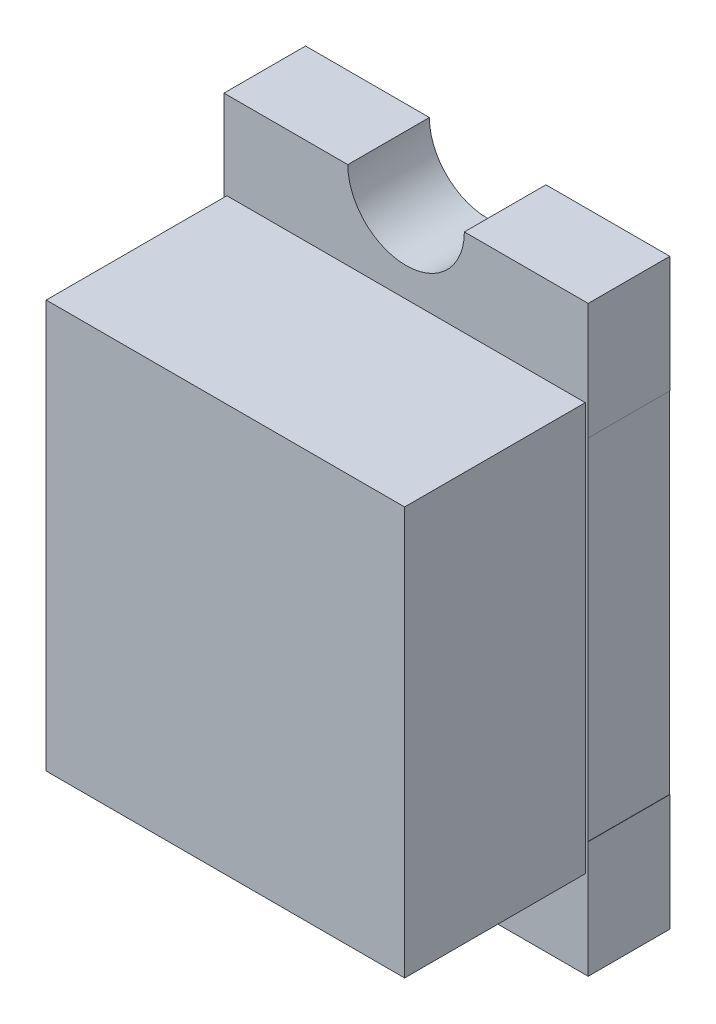
ISO-10303-21;
HEADER;
FILE_DESCRIPTION(('STEP AP214'),'2;1');
FILE_NAME('part.step','',(''),(''),'','','');
FILE_SCHEMA(('AUTOMOTIVE_DESIGN { 1 0 10303 214 1 1 1 1 }'));
ENDSEC;
DATA;
#1=APPLICATION_CONTEXT('core data for automotive mechanical design processes');
#2=APPLICATION_PROTOCOL_DEFINITION('international standard','automotive_design',2000,#1);
#3=PRODUCT_CONTEXT('',#1,'mechanical');
#4=PRODUCT('Part','Part','',(#3));
#5=PRODUCT_RELATED_PRODUCT_CATEGORY('part','',(#4));
#6=PRODUCT_DEFINITION_FORMATION('','',#4);
#7=PRODUCT_DEFINITION_CONTEXT('part definition',#1,'design');
#8=PRODUCT_DEFINITION('design','',#6,#7);
#9=PRODUCT_DEFINITION_SHAPE('','',#8);
#10=(LENGTH_UNIT() NAMED_UNIT(*) SI_UNIT(.MILLI.,.METRE.));
#11=(NAMED_UNIT(*) PLANE_ANGLE_UNIT() SI_UNIT($,.RADIAN.));
#12=(NAMED_UNIT(*) SI_UNIT($,.STERADIAN.) SOLID_ANGLE_UNIT());
#13=UNCERTAINTY_MEASURE_WITH_UNIT(LENGTH_MEASURE(1.E-05),#10,'distance_accuracy_value','');
#14=(GEOMETRIC_REPRESENTATION_CONTEXT(3) GLOBAL_UNCERTAINTY_ASSIGNED_CONTEXT((#13)) GLOBAL_UNIT_ASSIGNED_CONTEXT((#10,
#11,#12)) REPRESENTATION_CONTEXT('',''));
#15=CARTESIAN_POINT('',(0.,0.,0.));
#16=DIRECTION('',(0.,0.,1.));
#17=DIRECTION('',(1.,0.,0.));
#18=AXIS2_PLACEMENT_3D('',#15,#16,#17);
#19=CARTESIAN_POINT('',(0.,1.,0.));
#20=DIRECTION('',(0.,0.,1.));
#21=DIRECTION('',(0.,-1.,0.));
#22=AXIS2_PLACEMENT_3D('',#19,#20,#21);
#23=CYLINDRICAL_SURFACE('',#22,0.2);
#24=DIRECTION('',(0.,0.,1.));
#25=VECTOR('',#24,1.);
#26=CARTESIAN_POINT('',(-0.2,1.,0.));
#27=LINE('',#26,#25);
#28=CARTESIAN_POINT('',(-0.2,1.,0.));
#29=VERTEX_POINT('',#28);
#30=CARTESIAN_POINT('',(-0.2,1.,0.28));
#31=VERTEX_POINT('',#30);
#32=EDGE_CURVE('E296',#29,#31,#27,.T.);
#33=ORIENTED_EDGE('',*,*,#32,.T.);
#34=CARTESIAN_POINT('',(0.,1.,0.28));
#35=DIRECTION('',(0.,0.,1.));
#36=DIRECTION('',(0.,1.,0.));
#37=AXIS2_PLACEMENT_3D('',#34,#35,#36);
#38=CIRCLE('',#37,0.2);
#39=CARTESIAN_POINT('',(0.2,1.,0.28));
#40=VERTEX_POINT('',#39);
#41=EDGE_CURVE('E95',#31,#40,#38,.T.);
#42=ORIENTED_EDGE('',*,*,#41,.T.);
#43=DIRECTION('',(0.,0.,1.));
#44=VECTOR('',#43,1.);
#45=CARTESIAN_POINT('',(0.2,1.,0.));
#46=LINE('',#45,#44);
#47=CARTESIAN_POINT('',(0.2,1.,0.));
#48=VERTEX_POINT('',#47);
#49=EDGE_CURVE('E351',#48,#40,#46,.T.);
#50=ORIENTED_EDGE('',*,*,#49,.F.);
#51=CARTESIAN_POINT('',(0.,1.,0.));
#52=DIRECTION('',(0.,0.,1.));
#53=DIRECTION('',(0.,1.,0.));
#54=AXIS2_PLACEMENT_3D('',#51,#52,#53);
#55=CIRCLE('',#54,0.2);
#56=EDGE_CURVE('E445',#29,#48,#55,.T.);
#57=ORIENTED_EDGE('',*,*,#56,.F.);
#58=EDGE_LOOP('',(#33,#42,#50,#57));
#59=FACE_BOUND('',#58,.T.);
#60=ADVANCED_FACE('F18',(#59),#23,.F.);
#61=CARTESIAN_POINT('',(0.624,-0.6,1.480000416667));
#62=DIRECTION('',(0.,-1.,0.));
#63=DIRECTION('',(-1.,0.,0.));
#64=AXIS2_PLACEMENT_3D('',#61,#62,#63);
#65=PLANE('',#64);
#66=DIRECTION('',(0.,0.,-1.));
#67=VECTOR('',#66,1.);
#68=CARTESIAN_POINT('',(0.625,-0.6,1.480000416667));
#69=LINE('',#68,#67);
#70=CARTESIAN_POINT('',(0.625,-0.6,0.28));
#71=VERTEX_POINT('',#70);
#72=CARTESIAN_POINT('',(0.625,-0.6,0.));
#73=VERTEX_POINT('',#72);
#74=EDGE_CURVE('E411',#71,#73,#69,.T.);
#75=ORIENTED_EDGE('',*,*,#74,.T.);
#76=DIRECTION('',(-1.,0.,0.));
#77=VECTOR('',#76,1.);
#78=CARTESIAN_POINT('',(0.624,-0.6,0.));
#79=LINE('',#78,#77);
#80=CARTESIAN_POINT('',(0.624,-0.6,0.));
#81=VERTEX_POINT('',#80);
#82=EDGE_CURVE('E315',#73,#81,#79,.T.);
#83=ORIENTED_EDGE('',*,*,#82,.T.);
#84=DIRECTION('',(0.,0.,-1.));
#85=VECTOR('',#84,1.);
#86=CARTESIAN_POINT('',(0.624,-0.6,1.480000416667));
#87=LINE('',#86,#85);
#88=CARTESIAN_POINT('',(0.624,-0.6,0.28));
#89=VERTEX_POINT('',#88);
#90=EDGE_CURVE('E29',#89,#81,#87,.T.);
#91=ORIENTED_EDGE('',*,*,#90,.F.);
#92=DIRECTION('',(-1.,0.,0.));
#93=VECTOR('',#92,1.);
#94=CARTESIAN_POINT('',(0.624,-0.6,0.28));
#95=LINE('',#94,#93);
#96=EDGE_CURVE('E350',#71,#89,#95,.T.);
#97=ORIENTED_EDGE('',*,*,#96,.F.);
#98=EDGE_LOOP('',(#75,#83,#91,#97));
#99=FACE_BOUND('',#98,.T.);
#100=ADVANCED_FACE('F716',(#99),#65,.F.);
#101=CARTESIAN_POINT('',(0.624,0.6,1.480000416667));
#102=DIRECTION('',(0.,1.,0.));
#103=DIRECTION('',(1.,0.,0.));
#104=AXIS2_PLACEMENT_3D('',#101,#102,#103);
#105=PLANE('',#104);
#106=DIRECTION('',(0.,0.,-1.));
#107=VECTOR('',#106,1.);
#108=CARTESIAN_POINT('',(0.624,0.6,1.480000416667));
#109=LINE('',#108,#107);
#110=CARTESIAN_POINT('',(0.624,0.6,0.28));
#111=VERTEX_POINT('',#110);
#112=CARTESIAN_POINT('',(0.624,0.6,0.));
#113=VERTEX_POINT('',#112);
#114=EDGE_CURVE('E11',#111,#113,#109,.T.);
#115=ORIENTED_EDGE('',*,*,#114,.T.);
#116=DIRECTION('',(1.,0.,0.));
#117=VECTOR('',#116,1.);
#118=CARTESIAN_POINT('',(0.624,0.6,0.));
#119=LINE('',#118,#117);
#120=CARTESIAN_POINT('',(0.625,0.6,0.));
#121=VERTEX_POINT('',#120);
#122=EDGE_CURVE('E336',#113,#121,#119,.T.);
#123=ORIENTED_EDGE('',*,*,#122,.T.);
#124=DIRECTION('',(0.,0.,-1.));
#125=VECTOR('',#124,1.);
#126=CARTESIAN_POINT('',(0.625,0.6,1.480000416667));
#127=LINE('',#126,#125);
#128=CARTESIAN_POINT('',(0.625,0.6,0.28));
#129=VERTEX_POINT('',#128);
#130=EDGE_CURVE('E291',#129,#121,#127,.T.);
#131=ORIENTED_EDGE('',*,*,#130,.F.);
#132=DIRECTION('',(1.,0.,0.));
#133=VECTOR('',#132,1.);
#134=CARTESIAN_POINT('',(0.624,0.6,0.28));
#135=LINE('',#134,#133);
#136=EDGE_CURVE('E431',#111,#129,#135,.T.);
#137=ORIENTED_EDGE('',*,*,#136,.F.);
#138=EDGE_LOOP('',(#115,#123,#131,#137));
#139=FACE_BOUND('',#138,.T.);
#140=ADVANCED_FACE('F712',(#139),#105,.F.);
#141=CARTESIAN_POINT('',(0.624,0.6,1.480000416667));
#142=DIRECTION('',(-1.,0.,0.));
#143=DIRECTION('',(0.,0.,1.));
#144=AXIS2_PLACEMENT_3D('',#141,#142,#143);
#145=PLANE('',#144);
#146=ORIENTED_EDGE('',*,*,#90,.T.);
#147=DIRECTION('',(0.,1.,0.));
#148=VECTOR('',#147,1.);
#149=CARTESIAN_POINT('',(0.624,0.6,0.));
#150=LINE('',#149,#148);
#151=CARTESIAN_POINT('',(0.624,0.,0.));
#152=VERTEX_POINT('',#151);
#153=EDGE_CURVE('E301',#81,#152,#150,.T.);
#154=ORIENTED_EDGE('',*,*,#153,.T.);
#155=DIRECTION('',(0.,1.,0.));
#156=VECTOR('',#155,1.);
#157=CARTESIAN_POINT('',(0.624,0.6,0.));
#158=LINE('',#157,#156);
#159=CARTESIAN_POINT('',(0.624,0.416,0.));
#160=VERTEX_POINT('',#159);
#161=EDGE_CURVE('E295',#152,#160,#158,.T.);
#162=ORIENTED_EDGE('',*,*,#161,.T.);
#163=DIRECTION('',(0.,1.,0.));
#164=VECTOR('',#163,1.);
#165=CARTESIAN_POINT('',(0.624,0.6,0.));
#166=LINE('',#165,#164);
#167=EDGE_CURVE('E335',#160,#113,#166,.T.);
#168=ORIENTED_EDGE('',*,*,#167,.T.);
#169=ORIENTED_EDGE('',*,*,#114,.F.);
#170=DIRECTION('',(0.,1.,0.));
#171=VECTOR('',#170,1.);
#172=CARTESIAN_POINT('',(0.624,0.6,0.28));
#173=LINE('',#172,#171);
#174=EDGE_CURVE('E428',#89,#111,#173,.T.);
#175=ORIENTED_EDGE('',*,*,#174,.F.);
#176=EDGE_LOOP('',(#146,#154,#162,#168,#169,#175));
#177=FACE_BOUND('',#176,.T.);
#178=ADVANCED_FACE('F542',(#177),#145,.F.);
#179=CARTESIAN_POINT('',(-0.625,-0.6,1.480000416667));
#180=DIRECTION('',(0.,-1.,0.));
#181=DIRECTION('',(-1.,0.,0.));
#182=AXIS2_PLACEMENT_3D('',#179,#180,#181);
#183=PLANE('',#182);
#184=DIRECTION('',(0.,0.,-1.));
#185=VECTOR('',#184,1.);
#186=CARTESIAN_POINT('',(-0.624,-0.6,1.480000416667));
#187=LINE('',#186,#185);
#188=CARTESIAN_POINT('',(-0.624,-0.6,0.28));
#189=VERTEX_POINT('',#188);
#190=CARTESIAN_POINT('',(-0.624,-0.6,0.));
#191=VERTEX_POINT('',#190);
#192=EDGE_CURVE('E322',#189,#191,#187,.T.);
#193=ORIENTED_EDGE('',*,*,#192,.T.);
#194=DIRECTION('',(-1.,0.,0.));
#195=VECTOR('',#194,1.);
#196=CARTESIAN_POINT('',(-0.625,-0.6,0.));
#197=LINE('',#196,#195);
#198=CARTESIAN_POINT('',(-0.625,-0.6,0.));
#199=VERTEX_POINT('',#198);
#200=EDGE_CURVE('E311',#191,#199,#197,.T.);
#201=ORIENTED_EDGE('',*,*,#200,.T.);
#202=DIRECTION('',(0.,0.,-1.));
#203=VECTOR('',#202,1.);
#204=CARTESIAN_POINT('',(-0.625,-0.6,1.480000416667));
#205=LINE('',#204,#203);
#206=CARTESIAN_POINT('',(-0.625,-0.6,0.28));
#207=VERTEX_POINT('',#206);
#208=EDGE_CURVE('E22',#207,#199,#205,.T.);
#209=ORIENTED_EDGE('',*,*,#208,.F.);
#210=DIRECTION('',(-1.,0.,0.));
#211=VECTOR('',#210,1.);
#212=CARTESIAN_POINT('',(-0.625,-0.6,0.28));
#213=LINE('',#212,#211);
#214=EDGE_CURVE('E155',#189,#207,#213,.T.);
#215=ORIENTED_EDGE('',*,*,#214,.F.);
#216=EDGE_LOOP('',(#193,#201,#209,#215));
#217=FACE_BOUND('',#216,.T.);
#218=ADVANCED_FACE('F835',(#217),#183,.F.);
#219=CARTESIAN_POINT('',(-0.624,0.6,1.480000416667));
#220=DIRECTION('',(1.,0.,0.));
#221=DIRECTION('',(0.,-1.,0.));
#222=AXIS2_PLACEMENT_3D('',#219,#220,#221);
#223=PLANE('',#222);
#224=DIRECTION('',(0.,0.,-1.));
#225=VECTOR('',#224,1.);
#226=CARTESIAN_POINT('',(-0.624,0.6,1.480000416667));
#227=LINE('',#226,#225);
#228=CARTESIAN_POINT('',(-0.624,0.6,0.28));
#229=VERTEX_POINT('',#228);
#230=CARTESIAN_POINT('',(-0.624,0.6,0.));
#231=VERTEX_POINT('',#230);
#232=EDGE_CURVE('E309',#229,#231,#227,.T.);
#233=ORIENTED_EDGE('',*,*,#232,.T.);
#234=DIRECTION('',(0.,-1.,0.));
#235=VECTOR('',#234,1.);
#236=CARTESIAN_POINT('',(-0.624,0.6,0.));
#237=LINE('',#236,#235);
#238=CARTESIAN_POINT('',(-0.624,0.416,0.));
#239=VERTEX_POINT('',#238);
#240=EDGE_CURVE('E446',#231,#239,#237,.T.);
#241=ORIENTED_EDGE('',*,*,#240,.T.);
#242=DIRECTION('',(0.,-1.,0.));
#243=VECTOR('',#242,1.);
#244=CARTESIAN_POINT('',(-0.624,0.6,0.));
#245=LINE('',#244,#243);
#246=CARTESIAN_POINT('',(-0.624,0.,0.));
#247=VERTEX_POINT('',#246);
#248=EDGE_CURVE('E292',#239,#247,#245,.T.);
#249=ORIENTED_EDGE('',*,*,#248,.T.);
#250=DIRECTION('',(0.,-1.,0.));
#251=VECTOR('',#250,1.);
#252=CARTESIAN_POINT('',(-0.624,0.6,0.));
#253=LINE('',#252,#251);
#254=EDGE_CURVE('E491',#247,#191,#253,.T.);
#255=ORIENTED_EDGE('',*,*,#254,.T.);
#256=ORIENTED_EDGE('',*,*,#192,.F.);
#257=DIRECTION('',(0.,-1.,0.));
#258=VECTOR('',#257,1.);
#259=CARTESIAN_POINT('',(-0.624,0.6,0.28));
#260=LINE('',#259,#258);
#261=EDGE_CURVE('E390',#229,#189,#260,.T.);
#262=ORIENTED_EDGE('',*,*,#261,.F.);
#263=EDGE_LOOP('',(#233,#241,#249,#255,#256,#262));
#264=FACE_BOUND('',#263,.T.);
#265=ADVANCED_FACE('F533',(#264),#223,.F.);
#266=CARTESIAN_POINT('',(-0.625,0.6,1.480000416667));
#267=DIRECTION('',(0.,1.,0.));
#268=DIRECTION('',(1.,0.,0.));
#269=AXIS2_PLACEMENT_3D('',#266,#267,#268);
#270=PLANE('',#269);
#271=DIRECTION('',(0.,0.,-1.));
#272=VECTOR('',#271,1.);
#273=CARTESIAN_POINT('',(-0.625,0.6,1.480000416667));
#274=LINE('',#273,#272);
#275=CARTESIAN_POINT('',(-0.625,0.6,0.28));
#276=VERTEX_POINT('',#275);
#277=CARTESIAN_POINT('',(-0.625,0.6,0.));
#278=VERTEX_POINT('',#277);
#279=EDGE_CURVE('E287',#276,#278,#274,.T.);
#280=ORIENTED_EDGE('',*,*,#279,.T.);
#281=DIRECTION('',(1.,0.,0.));
#282=VECTOR('',#281,1.);
#283=CARTESIAN_POINT('',(-0.625,0.6,0.));
#284=LINE('',#283,#282);
#285=EDGE_CURVE('E340',#278,#231,#284,.T.);
#286=ORIENTED_EDGE('',*,*,#285,.T.);
#287=ORIENTED_EDGE('',*,*,#232,.F.);
#288=DIRECTION('',(1.,0.,0.));
#289=VECTOR('',#288,1.);
#290=CARTESIAN_POINT('',(-0.625,0.6,0.28));
#291=LINE('',#290,#289);
#292=EDGE_CURVE('E395',#276,#229,#291,.T.);
#293=ORIENTED_EDGE('',*,*,#292,.F.);
#294=EDGE_LOOP('',(#280,#286,#287,#293));
#295=FACE_BOUND('',#294,.T.);
#296=ADVANCED_FACE('F690',(#295),#270,.F.);
#297=CARTESIAN_POINT('',(0.,0.,0.9));
#298=DIRECTION('',(0.,0.,1.));
#299=DIRECTION('',(1.,0.,0.));
#300=AXIS2_PLACEMENT_3D('',#297,#298,#299);
#301=PLANE('',#300);
#302=DIRECTION('',(0.,-1.,0.));
#303=VECTOR('',#302,1.);
#304=CARTESIAN_POINT('',(-0.615,0.7,0.9));
#305=LINE('',#304,#303);
#306=CARTESIAN_POINT('',(-0.615,0.7,0.9));
#307=VERTEX_POINT('',#306);
#308=CARTESIAN_POINT('',(-0.615,-0.7,0.9));
#309=VERTEX_POINT('',#308);
#310=EDGE_CURVE('E410',#307,#309,#305,.T.);
#311=ORIENTED_EDGE('',*,*,#310,.T.);
#312=DIRECTION('',(1.,0.,0.));
#313=VECTOR('',#312,1.);
#314=CARTESIAN_POINT('',(0.615,-0.7,0.9));
#315=LINE('',#314,#313);
#316=CARTESIAN_POINT('',(0.615,-0.7,0.9));
#317=VERTEX_POINT('',#316);
#318=EDGE_CURVE('E421',#309,#317,#315,.T.);
#319=ORIENTED_EDGE('',*,*,#318,.T.);
#320=DIRECTION('',(0.,1.,0.));
#321=VECTOR('',#320,1.);
#322=CARTESIAN_POINT('',(0.615,-0.7,0.9));
#323=LINE('',#322,#321);
#324=CARTESIAN_POINT('',(0.615,0.7,0.9));
#325=VERTEX_POINT('',#324);
#326=EDGE_CURVE('E310',#317,#325,#323,.T.);
#327=ORIENTED_EDGE('',*,*,#326,.T.);
#328=DIRECTION('',(-1.,0.,0.));
#329=VECTOR('',#328,1.);
#330=CARTESIAN_POINT('',(-0.615,0.7,0.9));
#331=LINE('',#330,#329);
#332=EDGE_CURVE('E43',#325,#307,#331,.T.);
#333=ORIENTED_EDGE('',*,*,#332,.T.);
#334=EDGE_LOOP('',(#311,#319,#327,#333));
#335=FACE_BOUND('',#334,.T.);
#336=ADVANCED_FACE('F20',(#335),#301,.T.);
#337=CARTESIAN_POINT('',(-0.615,0.7,0.9));
#338=DIRECTION('',(0.,-1.,0.));
#339=DIRECTION('',(-1.,0.,0.));
#340=AXIS2_PLACEMENT_3D('',#337,#338,#339);
#341=PLANE('',#340);
#342=DIRECTION('',(-1.,0.,0.));
#343=VECTOR('',#342,1.);
#344=CARTESIAN_POINT('',(-0.615,0.7,0.28));
#345=LINE('',#344,#343);
#346=CARTESIAN_POINT('',(0.615,0.7,0.28));
#347=VERTEX_POINT('',#346);
#348=CARTESIAN_POINT('',(-0.615,0.7,0.28));
#349=VERTEX_POINT('',#348);
#350=EDGE_CURVE('E347',#347,#349,#345,.T.);
#351=ORIENTED_EDGE('',*,*,#350,.T.);
#352=DIRECTION('',(0.,0.,-1.));
#353=VECTOR('',#352,1.);
#354=CARTESIAN_POINT('',(-0.615,0.7,0.9));
#355=LINE('',#354,#353);
#356=EDGE_CURVE('E415',#307,#349,#355,.T.);
#357=ORIENTED_EDGE('',*,*,#356,.F.);
#358=ORIENTED_EDGE('',*,*,#332,.F.);
#359=DIRECTION('',(0.,0.,-1.));
#360=VECTOR('',#359,1.);
#361=CARTESIAN_POINT('',(0.615,0.7,0.9));
#362=LINE('',#361,#360);
#363=EDGE_CURVE('E434',#325,#347,#362,.T.);
#364=ORIENTED_EDGE('',*,*,#363,.T.);
#365=EDGE_LOOP('',(#351,#357,#358,#364));
#366=FACE_BOUND('',#365,.T.);
#367=ADVANCED_FACE('F689',(#366),#341,.F.);
#368=CARTESIAN_POINT('',(0.615,-0.7,0.9));
#369=DIRECTION('',(-1.,0.,0.));
#370=DIRECTION('',(0.,0.,1.));
#371=AXIS2_PLACEMENT_3D('',#368,#369,#370);
#372=PLANE('',#371);
#373=DIRECTION('',(0.,1.,0.));
#374=VECTOR('',#373,1.);
#375=CARTESIAN_POINT('',(0.615,-0.7,0.28));
#376=LINE('',#375,#374);
#377=CARTESIAN_POINT('',(0.615,-0.7,0.28));
#378=VERTEX_POINT('',#377);
#379=EDGE_CURVE('E342',#378,#347,#376,.T.);
#380=ORIENTED_EDGE('',*,*,#379,.T.);
#381=ORIENTED_EDGE('',*,*,#363,.F.);
#382=ORIENTED_EDGE('',*,*,#326,.F.);
#383=DIRECTION('',(0.,0.,-1.));
#384=VECTOR('',#383,1.);
#385=CARTESIAN_POINT('',(0.615,-0.7,0.9));
#386=LINE('',#385,#384);
#387=EDGE_CURVE('E418',#317,#378,#386,.T.);
#388=ORIENTED_EDGE('',*,*,#387,.T.);
#389=EDGE_LOOP('',(#380,#381,#382,#388));
#390=FACE_BOUND('',#389,.T.);
#391=ADVANCED_FACE('F766',(#390),#372,.F.);
#392=CARTESIAN_POINT('',(0.615,-0.7,0.9));
#393=DIRECTION('',(0.,1.,0.));
#394=DIRECTION('',(1.,0.,0.));
#395=AXIS2_PLACEMENT_3D('',#392,#393,#394);
#396=PLANE('',#395);
#397=DIRECTION('',(1.,0.,0.));
#398=VECTOR('',#397,1.);
#399=CARTESIAN_POINT('',(0.615,-0.7,0.28));
#400=LINE('',#399,#398);
#401=CARTESIAN_POINT('',(-0.615,-0.7,0.28));
#402=VERTEX_POINT('',#401);
#403=EDGE_CURVE('E346',#402,#378,#400,.T.);
#404=ORIENTED_EDGE('',*,*,#403,.T.);
#405=ORIENTED_EDGE('',*,*,#387,.F.);
#406=ORIENTED_EDGE('',*,*,#318,.F.);
#407=DIRECTION('',(0.,0.,-1.));
#408=VECTOR('',#407,1.);
#409=CARTESIAN_POINT('',(-0.615,-0.7,0.9));
#410=LINE('',#409,#408);
#411=EDGE_CURVE('E405',#309,#402,#410,.T.);
#412=ORIENTED_EDGE('',*,*,#411,.T.);
#413=EDGE_LOOP('',(#404,#405,#406,#412));
#414=FACE_BOUND('',#413,.T.);
#415=ADVANCED_FACE('F707',(#414),#396,.F.);
#416=CARTESIAN_POINT('',(-0.615,0.7,0.9));
#417=DIRECTION('',(1.,0.,0.));
#418=DIRECTION('',(0.,0.,1.));
#419=AXIS2_PLACEMENT_3D('',#416,#417,#418);
#420=PLANE('',#419);
#421=DIRECTION('',(0.,-1.,0.));
#422=VECTOR('',#421,1.);
#423=CARTESIAN_POINT('',(-0.615,0.7,0.28));
#424=LINE('',#423,#422);
#425=EDGE_CURVE('E378',#349,#402,#424,.T.);
#426=ORIENTED_EDGE('',*,*,#425,.T.);
#427=ORIENTED_EDGE('',*,*,#411,.F.);
#428=ORIENTED_EDGE('',*,*,#310,.F.);
#429=ORIENTED_EDGE('',*,*,#356,.T.);
#430=EDGE_LOOP('',(#426,#427,#428,#429));
#431=FACE_BOUND('',#430,.T.);
#432=ADVANCED_FACE('F702',(#431),#420,.F.);
#433=CARTESIAN_POINT('',(0.,0.,0.28));
#434=DIRECTION('',(0.,0.,1.));
#435=DIRECTION('',(1.,0.,0.));
#436=AXIS2_PLACEMENT_3D('',#433,#434,#435);
#437=PLANE('',#436);
#438=ORIENTED_EDGE('',*,*,#425,.F.);
#439=ORIENTED_EDGE('',*,*,#350,.F.);
#440=ORIENTED_EDGE('',*,*,#379,.F.);
#441=ORIENTED_EDGE('',*,*,#403,.F.);
#442=EDGE_LOOP('',(#438,#439,#440,#441));
#443=FACE_BOUND('',#442,.T.);
#444=CARTESIAN_POINT('',(0.,-1.,0.28));
#445=DIRECTION('',(0.,0.,1.));
#446=DIRECTION('',(0.,1.,0.));
#447=AXIS2_PLACEMENT_3D('',#444,#445,#446);
#448=CIRCLE('',#447,0.2);
#449=CARTESIAN_POINT('',(0.2,-1.,0.28));
#450=VERTEX_POINT('',#449);
#451=CARTESIAN_POINT('',(-0.2,-1.,0.28));
#452=VERTEX_POINT('',#451);
#453=EDGE_CURVE('E273',#450,#452,#448,.T.);
#454=ORIENTED_EDGE('',*,*,#453,.F.);
#455=DIRECTION('',(1.,0.,0.));
#456=VECTOR('',#455,1.);
#457=CARTESIAN_POINT('',(-0.625,-1.,0.28));
#458=LINE('',#457,#456);
#459=CARTESIAN_POINT('',(0.625,-1.,0.28));
#460=VERTEX_POINT('',#459);
#461=EDGE_CURVE('E268',#450,#460,#458,.T.);
#462=ORIENTED_EDGE('',*,*,#461,.T.);
#463=DIRECTION('',(0.,1.,0.));
#464=VECTOR('',#463,1.);
#465=CARTESIAN_POINT('',(0.625,-1.,0.28));
#466=LINE('',#465,#464);
#467=EDGE_CURVE('E143',#460,#71,#466,.T.);
#468=ORIENTED_EDGE('',*,*,#467,.T.);
#469=ORIENTED_EDGE('',*,*,#96,.T.);
#470=ORIENTED_EDGE('',*,*,#174,.T.);
#471=ORIENTED_EDGE('',*,*,#136,.T.);
#472=DIRECTION('',(0.,1.,0.));
#473=VECTOR('',#472,1.);
#474=CARTESIAN_POINT('',(0.625,-1.,0.28));
#475=LINE('',#474,#473);
#476=CARTESIAN_POINT('',(0.625,1.,0.28));
#477=VERTEX_POINT('',#476);
#478=EDGE_CURVE('E78',#129,#477,#475,.T.);
#479=ORIENTED_EDGE('',*,*,#478,.T.);
#480=DIRECTION('',(-1.,0.,0.));
#481=VECTOR('',#480,1.);
#482=CARTESIAN_POINT('',(0.625,1.,0.28));
#483=LINE('',#482,#481);
#484=EDGE_CURVE('E354',#477,#40,#483,.T.);
#485=ORIENTED_EDGE('',*,*,#484,.T.);
#486=ORIENTED_EDGE('',*,*,#41,.F.);
#487=DIRECTION('',(-1.,0.,0.));
#488=VECTOR('',#487,1.);
#489=CARTESIAN_POINT('',(0.625,1.,0.28));
#490=LINE('',#489,#488);
#491=CARTESIAN_POINT('',(-0.625,1.,0.28));
#492=VERTEX_POINT('',#491);
#493=EDGE_CURVE('E300',#31,#492,#490,.T.);
#494=ORIENTED_EDGE('',*,*,#493,.T.);
#495=DIRECTION('',(0.,-1.,0.));
#496=VECTOR('',#495,1.);
#497=CARTESIAN_POINT('',(-0.625,1.,0.28));
#498=LINE('',#497,#496);
#499=EDGE_CURVE('E290',#492,#276,#498,.T.);
#500=ORIENTED_EDGE('',*,*,#499,.T.);
#501=ORIENTED_EDGE('',*,*,#292,.T.);
#502=ORIENTED_EDGE('',*,*,#261,.T.);
#503=ORIENTED_EDGE('',*,*,#214,.T.);
#504=DIRECTION('',(0.,-1.,0.));
#505=VECTOR('',#504,1.);
#506=CARTESIAN_POINT('',(-0.625,1.,0.28));
#507=LINE('',#506,#505);
#508=CARTESIAN_POINT('',(-0.625,-1.,0.28));
#509=VERTEX_POINT('',#508);
#510=EDGE_CURVE('E299',#207,#509,#507,.T.);
#511=ORIENTED_EDGE('',*,*,#510,.T.);
#512=DIRECTION('',(1.,0.,0.));
#513=VECTOR('',#512,1.);
#514=CARTESIAN_POINT('',(-0.625,-1.,0.28));
#515=LINE('',#514,#513);
#516=EDGE_CURVE('E373',#509,#452,#515,.T.);
#517=ORIENTED_EDGE('',*,*,#516,.T.);
#518=EDGE_LOOP('',(#454,#462,#468,#469,#470,#471,#479,#485,#486,#494,#500,#501,#502,#503,#511,#517));
#519=FACE_BOUND('',#518,.T.);
#520=ADVANCED_FACE('F706',(#443,#519),#437,.T.);
#521=CARTESIAN_POINT('',(0.,0.,0.));
#522=DIRECTION('',(0.,0.,1.));
#523=DIRECTION('',(1.,0.,0.));
#524=AXIS2_PLACEMENT_3D('',#521,#522,#523);
#525=PLANE('',#524);
#526=ORIENTED_EDGE('',*,*,#248,.F.);
#527=DIRECTION('',(1.,0.,0.));
#528=VECTOR('',#527,1.);
#529=CARTESIAN_POINT('',(0.,0.416,0.));
#530=LINE('',#529,#528);
#531=EDGE_CURVE('E450',#239,#160,#530,.T.);
#532=ORIENTED_EDGE('',*,*,#531,.T.);
#533=ORIENTED_EDGE('',*,*,#161,.F.);
#534=DIRECTION('',(-1.,0.,0.));
#535=VECTOR('',#534,1.);
#536=CARTESIAN_POINT('',(0.,0.,0.));
#537=LINE('',#536,#535);
#538=CARTESIAN_POINT('',(0.208,0.,0.));
#539=VERTEX_POINT('',#538);
#540=EDGE_CURVE('E306',#152,#539,#537,.T.);
#541=ORIENTED_EDGE('',*,*,#540,.T.);
#542=DIRECTION('',(0.,-1.,0.));
#543=VECTOR('',#542,1.);
#544=CARTESIAN_POINT('',(0.208,0.,0.));
#545=LINE('',#544,#543);
#546=CARTESIAN_POINT('',(0.208,-0.416,0.));
#547=VERTEX_POINT('',#546);
#548=EDGE_CURVE('E329',#539,#547,#545,.T.);
#549=ORIENTED_EDGE('',*,*,#548,.T.);
#550=DIRECTION('',(-1.,0.,0.));
#551=VECTOR('',#550,1.);
#552=CARTESIAN_POINT('',(0.,-0.416,0.));
#553=LINE('',#552,#551);
#554=CARTESIAN_POINT('',(-0.208,-0.416,0.));
#555=VERTEX_POINT('',#554);
#556=EDGE_CURVE('E327',#547,#555,#553,.T.);
#557=ORIENTED_EDGE('',*,*,#556,.T.);
#558=DIRECTION('',(0.,1.,0.));
#559=VECTOR('',#558,1.);
#560=CARTESIAN_POINT('',(-0.208,0.,0.));
#561=LINE('',#560,#559);
#562=CARTESIAN_POINT('',(-0.208,0.,0.));
#563=VERTEX_POINT('',#562);
#564=EDGE_CURVE('E330',#555,#563,#561,.T.);
#565=ORIENTED_EDGE('',*,*,#564,.T.);
#566=DIRECTION('',(-1.,0.,0.));
#567=VECTOR('',#566,1.);
#568=CARTESIAN_POINT('',(0.,0.,0.));
#569=LINE('',#568,#567);
#570=EDGE_CURVE('E487',#563,#247,#569,.T.);
#571=ORIENTED_EDGE('',*,*,#570,.T.);
#572=EDGE_LOOP('',(#526,#532,#533,#541,#549,#557,#565,#571));
#573=FACE_BOUND('',#572,.T.);
#574=ADVANCED_FACE('F521',(#573),#525,.F.);
#575=CARTESIAN_POINT('',(0.625,-1.,0.9));
#576=DIRECTION('',(-1.,0.,0.));
#577=DIRECTION('',(0.,0.,1.));
#578=AXIS2_PLACEMENT_3D('',#575,#576,#577);
#579=PLANE('',#578);
#580=DIRECTION('',(0.,1.,0.));
#581=VECTOR('',#580,1.);
#582=CARTESIAN_POINT('',(0.625,-1.,0.));
#583=LINE('',#582,#581);
#584=CARTESIAN_POINT('',(0.625,-1.,0.));
#585=VERTEX_POINT('',#584);
#586=EDGE_CURVE('E258',#585,#73,#583,.T.);
#587=ORIENTED_EDGE('',*,*,#586,.T.);
#588=ORIENTED_EDGE('',*,*,#74,.F.);
#589=ORIENTED_EDGE('',*,*,#467,.F.);
#590=DIRECTION('',(0.,0.,-1.));
#591=VECTOR('',#590,1.);
#592=CARTESIAN_POINT('',(0.625,-1.,0.9));
#593=LINE('',#592,#591);
#594=EDGE_CURVE('E414',#460,#585,#593,.T.);
#595=ORIENTED_EDGE('',*,*,#594,.T.);
#596=EDGE_LOOP('',(#587,#588,#589,#595));
#597=FACE_BOUND('',#596,.T.);
#598=ADVANCED_FACE('F751',(#597),#579,.F.);
#599=CARTESIAN_POINT('',(-0.625,-1.,0.9));
#600=DIRECTION('',(0.,1.,0.));
#601=DIRECTION('',(0.,0.,-1.));
#602=AXIS2_PLACEMENT_3D('',#599,#600,#601);
#603=PLANE('',#602);
#604=ORIENTED_EDGE('',*,*,#461,.F.);
#605=DIRECTION('',(0.,0.,1.));
#606=VECTOR('',#605,1.);
#607=CARTESIAN_POINT('',(0.2,-1.,0.));
#608=LINE('',#607,#606);
#609=CARTESIAN_POINT('',(0.2,-1.,0.));
#610=VERTEX_POINT('',#609);
#611=EDGE_CURVE('E265',#610,#450,#608,.T.);
#612=ORIENTED_EDGE('',*,*,#611,.F.);
#613=DIRECTION('',(1.,0.,0.));
#614=VECTOR('',#613,1.);
#615=CARTESIAN_POINT('',(-0.625,-1.,0.));
#616=LINE('',#615,#614);
#617=EDGE_CURVE('E249',#610,#585,#616,.T.);
#618=ORIENTED_EDGE('',*,*,#617,.T.);
#619=ORIENTED_EDGE('',*,*,#594,.F.);
#620=EDGE_LOOP('',(#604,#612,#618,#619));
#621=FACE_BOUND('',#620,.T.);
#622=ADVANCED_FACE('F266',(#621),#603,.F.);
#623=CARTESIAN_POINT('',(-0.625,-1.,0.9));
#624=DIRECTION('',(1.,0.,0.));
#625=DIRECTION('',(0.,-1.,0.));
#626=AXIS2_PLACEMENT_3D('',#623,#624,#625);
#627=PLANE('',#626);
#628=ORIENTED_EDGE('',*,*,#510,.F.);
#629=ORIENTED_EDGE('',*,*,#208,.T.);
#630=DIRECTION('',(0.,-1.,0.));
#631=VECTOR('',#630,1.);
#632=CARTESIAN_POINT('',(-0.625,-1.,0.));
#633=LINE('',#632,#631);
#634=CARTESIAN_POINT('',(-0.625,-1.,0.));
#635=VERTEX_POINT('',#634);
#636=EDGE_CURVE('E261',#199,#635,#633,.T.);
#637=ORIENTED_EDGE('',*,*,#636,.T.);
#638=DIRECTION('',(0.,0.,-1.));
#639=VECTOR('',#638,1.);
#640=CARTESIAN_POINT('',(-0.625,-1.,0.9));
#641=LINE('',#640,#639);
#642=EDGE_CURVE('E365',#509,#635,#641,.T.);
#643=ORIENTED_EDGE('',*,*,#642,.F.);
#644=EDGE_LOOP('',(#628,#629,#637,#643));
#645=FACE_BOUND('',#644,.T.);
#646=ADVANCED_FACE('F730',(#645),#627,.F.);
#647=CARTESIAN_POINT('',(-0.625,1.,0.9));
#648=DIRECTION('',(0.,-1.,0.));
#649=DIRECTION('',(-1.,0.,0.));
#650=AXIS2_PLACEMENT_3D('',#647,#648,#649);
#651=PLANE('',#650);
#652=ORIENTED_EDGE('',*,*,#493,.F.);
#653=ORIENTED_EDGE('',*,*,#32,.F.);
#654=DIRECTION('',(-1.,0.,0.));
#655=VECTOR('',#654,1.);
#656=CARTESIAN_POINT('',(-0.625,1.,0.));
#657=LINE('',#656,#655);
#658=CARTESIAN_POINT('',(-0.625,1.,0.));
#659=VERTEX_POINT('',#658);
#660=EDGE_CURVE('E441',#29,#659,#657,.T.);
#661=ORIENTED_EDGE('',*,*,#660,.T.);
#662=DIRECTION('',(0.,0.,-1.));
#663=VECTOR('',#662,1.);
#664=CARTESIAN_POINT('',(-0.625,1.,0.9));
#665=LINE('',#664,#663);
#666=EDGE_CURVE('E321',#492,#659,#665,.T.);
#667=ORIENTED_EDGE('',*,*,#666,.F.);
#668=EDGE_LOOP('',(#652,#653,#661,#667));
#669=FACE_BOUND('',#668,.T.);
#670=ADVANCED_FACE('F734',(#669),#651,.F.);
#671=CARTESIAN_POINT('',(-0.625,-1.,0.9));
#672=DIRECTION('',(1.,0.,0.));
#673=DIRECTION('',(0.,-1.,0.));
#674=AXIS2_PLACEMENT_3D('',#671,#672,#673);
#675=PLANE('',#674);
#676=DIRECTION('',(0.,-1.,0.));
#677=VECTOR('',#676,1.);
#678=CARTESIAN_POINT('',(-0.625,-1.,0.));
#679=LINE('',#678,#677);
#680=EDGE_CURVE('E262',#659,#278,#679,.T.);
#681=ORIENTED_EDGE('',*,*,#680,.T.);
#682=ORIENTED_EDGE('',*,*,#279,.F.);
#683=ORIENTED_EDGE('',*,*,#499,.F.);
#684=ORIENTED_EDGE('',*,*,#666,.T.);
#685=EDGE_LOOP('',(#681,#682,#683,#684));
#686=FACE_BOUND('',#685,.T.);
#687=ADVANCED_FACE('F820',(#686),#675,.F.);
#688=CARTESIAN_POINT('',(0.625,-1.,0.9));
#689=DIRECTION('',(-1.,0.,0.));
#690=DIRECTION('',(0.,0.,1.));
#691=AXIS2_PLACEMENT_3D('',#688,#689,#690);
#692=PLANE('',#691);
#693=ORIENTED_EDGE('',*,*,#478,.F.);
#694=ORIENTED_EDGE('',*,*,#130,.T.);
#695=DIRECTION('',(0.,1.,0.));
#696=VECTOR('',#695,1.);
#697=CARTESIAN_POINT('',(0.625,-1.,0.));
#698=LINE('',#697,#696);
#699=CARTESIAN_POINT('',(0.625,1.,0.));
#700=VERTEX_POINT('',#699);
#701=EDGE_CURVE('E341',#121,#700,#698,.T.);
#702=ORIENTED_EDGE('',*,*,#701,.T.);
#703=DIRECTION('',(0.,0.,-1.));
#704=VECTOR('',#703,1.);
#705=CARTESIAN_POINT('',(0.625,1.,0.9));
#706=LINE('',#705,#704);
#707=EDGE_CURVE('E363',#477,#700,#706,.T.);
#708=ORIENTED_EDGE('',*,*,#707,.F.);
#709=EDGE_LOOP('',(#693,#694,#702,#708));
#710=FACE_BOUND('',#709,.T.);
#711=ADVANCED_FACE('F789',(#710),#692,.F.);
#712=CARTESIAN_POINT('',(0.,0.,0.));
#713=DIRECTION('',(0.,0.,1.));
#714=DIRECTION('',(1.,0.,0.));
#715=AXIS2_PLACEMENT_3D('',#712,#713,#714);
#716=PLANE('',#715);
#717=ORIENTED_EDGE('',*,*,#617,.F.);
#718=CARTESIAN_POINT('',(0.,-1.,0.));
#719=DIRECTION('',(0.,0.,1.));
#720=DIRECTION('',(0.,1.,0.));
#721=AXIS2_PLACEMENT_3D('',#718,#719,#720);
#722=CIRCLE('',#721,0.2);
#723=CARTESIAN_POINT('',(-0.2,-1.,0.));
#724=VERTEX_POINT('',#723);
#725=EDGE_CURVE('E254',#610,#724,#722,.T.);
#726=ORIENTED_EDGE('',*,*,#725,.T.);
#727=DIRECTION('',(1.,0.,0.));
#728=VECTOR('',#727,1.);
#729=CARTESIAN_POINT('',(-0.625,-1.,0.));
#730=LINE('',#729,#728);
#731=EDGE_CURVE('E427',#635,#724,#730,.T.);
#732=ORIENTED_EDGE('',*,*,#731,.F.);
#733=ORIENTED_EDGE('',*,*,#636,.F.);
#734=ORIENTED_EDGE('',*,*,#200,.F.);
#735=DIRECTION('',(1.,0.,0.));
#736=VECTOR('',#735,1.);
#737=CARTESIAN_POINT('',(0.,-0.6,0.));
#738=LINE('',#737,#736);
#739=EDGE_CURVE('E376',#191,#81,#738,.T.);
#740=ORIENTED_EDGE('',*,*,#739,.T.);
#741=ORIENTED_EDGE('',*,*,#82,.F.);
#742=ORIENTED_EDGE('',*,*,#586,.F.);
#743=EDGE_LOOP('',(#717,#726,#732,#733,#734,#740,#741,#742));
#744=FACE_BOUND('',#743,.T.);
#745=ADVANCED_FACE('F251',(#744),#716,.F.);
#746=CARTESIAN_POINT('',(0.,0.,0.));
#747=DIRECTION('',(0.,0.,1.));
#748=DIRECTION('',(1.,0.,0.));
#749=AXIS2_PLACEMENT_3D('',#746,#747,#748);
#750=PLANE('',#749);
#751=ORIENTED_EDGE('',*,*,#660,.F.);
#752=ORIENTED_EDGE('',*,*,#56,.T.);
#753=DIRECTION('',(-1.,0.,0.));
#754=VECTOR('',#753,1.);
#755=CARTESIAN_POINT('',(-0.625,1.,0.));
#756=LINE('',#755,#754);
#757=EDGE_CURVE('E355',#700,#48,#756,.T.);
#758=ORIENTED_EDGE('',*,*,#757,.F.);
#759=ORIENTED_EDGE('',*,*,#701,.F.);
#760=ORIENTED_EDGE('',*,*,#122,.F.);
#761=DIRECTION('',(-1.,0.,0.));
#762=VECTOR('',#761,1.);
#763=CARTESIAN_POINT('',(0.,0.6,0.));
#764=LINE('',#763,#762);
#765=EDGE_CURVE('E305',#113,#231,#764,.T.);
#766=ORIENTED_EDGE('',*,*,#765,.T.);
#767=ORIENTED_EDGE('',*,*,#285,.F.);
#768=ORIENTED_EDGE('',*,*,#680,.F.);
#769=EDGE_LOOP('',(#751,#752,#758,#759,#760,#766,#767,#768));
#770=FACE_BOUND('',#769,.T.);
#771=ADVANCED_FACE('F695',(#770),#750,.F.);
#772=CARTESIAN_POINT('',(0.,0.,0.));
#773=DIRECTION('',(0.,0.,1.));
#774=DIRECTION('',(1.,0.,0.));
#775=AXIS2_PLACEMENT_3D('',#772,#773,#774);
#776=PLANE('',#775);
#777=ORIENTED_EDGE('',*,*,#765,.F.);
#778=ORIENTED_EDGE('',*,*,#167,.F.);
#779=ORIENTED_EDGE('',*,*,#531,.F.);
#780=ORIENTED_EDGE('',*,*,#240,.F.);
#781=EDGE_LOOP('',(#777,#778,#779,#780));
#782=FACE_BOUND('',#781,.T.);
#783=ADVANCED_FACE('F540',(#782),#776,.F.);
#784=CARTESIAN_POINT('',(0.,0.,0.));
#785=DIRECTION('',(0.,0.,1.));
#786=DIRECTION('',(1.,0.,0.));
#787=AXIS2_PLACEMENT_3D('',#784,#785,#786);
#788=PLANE('',#787);
#789=ORIENTED_EDGE('',*,*,#739,.F.);
#790=ORIENTED_EDGE('',*,*,#254,.F.);
#791=ORIENTED_EDGE('',*,*,#570,.F.);
#792=ORIENTED_EDGE('',*,*,#564,.F.);
#793=ORIENTED_EDGE('',*,*,#556,.F.);
#794=ORIENTED_EDGE('',*,*,#548,.F.);
#795=ORIENTED_EDGE('',*,*,#540,.F.);
#796=ORIENTED_EDGE('',*,*,#153,.F.);
#797=EDGE_LOOP('',(#789,#790,#791,#792,#793,#794,#795,#796));
#798=FACE_BOUND('',#797,.T.);
#799=ADVANCED_FACE('F526',(#798),#788,.F.);
#800=CARTESIAN_POINT('',(-0.625,1.,0.9));
#801=DIRECTION('',(0.,-1.,0.));
#802=DIRECTION('',(-1.,0.,0.));
#803=AXIS2_PLACEMENT_3D('',#800,#801,#802);
#804=PLANE('',#803);
#805=ORIENTED_EDGE('',*,*,#757,.T.);
#806=ORIENTED_EDGE('',*,*,#49,.T.);
#807=ORIENTED_EDGE('',*,*,#484,.F.);
#808=ORIENTED_EDGE('',*,*,#707,.T.);
#809=EDGE_LOOP('',(#805,#806,#807,#808));
#810=FACE_BOUND('',#809,.T.);
#811=ADVANCED_FACE('F797',(#810),#804,.F.);
#812=CARTESIAN_POINT('',(-0.625,-1.,0.9));
#813=DIRECTION('',(0.,1.,0.));
#814=DIRECTION('',(0.,0.,-1.));
#815=AXIS2_PLACEMENT_3D('',#812,#813,#814);
#816=PLANE('',#815);
#817=ORIENTED_EDGE('',*,*,#731,.T.);
#818=DIRECTION('',(0.,0.,1.));
#819=VECTOR('',#818,1.);
#820=CARTESIAN_POINT('',(-0.2,-1.,0.));
#821=LINE('',#820,#819);
#822=EDGE_CURVE('E277',#724,#452,#821,.T.);
#823=ORIENTED_EDGE('',*,*,#822,.T.);
#824=ORIENTED_EDGE('',*,*,#516,.F.);
#825=ORIENTED_EDGE('',*,*,#642,.T.);
#826=EDGE_LOOP('',(#817,#823,#824,#825));
#827=FACE_BOUND('',#826,.T.);
#828=ADVANCED_FACE('F743',(#827),#816,.F.);
#829=CARTESIAN_POINT('',(0.,-1.,0.));
#830=DIRECTION('',(0.,0.,1.));
#831=DIRECTION('',(0.,1.,0.));
#832=AXIS2_PLACEMENT_3D('',#829,#830,#831);
#833=CYLINDRICAL_SURFACE('',#832,0.2);
#834=ORIENTED_EDGE('',*,*,#822,.F.);
#835=ORIENTED_EDGE('',*,*,#725,.F.);
#836=ORIENTED_EDGE('',*,*,#611,.T.);
#837=ORIENTED_EDGE('',*,*,#453,.T.);
#838=EDGE_LOOP('',(#834,#835,#836,#837));
#839=FACE_BOUND('',#838,.T.);
#840=ADVANCED_FACE('F275',(#839),#833,.F.);
#841=CLOSED_SHELL('',(#60,#100,#140,#178,#218,#265,#296,#336,#367,#391,#415,#432,#520,#574,#598,
#622,#646,#670,#687,#711,#745,#771,#783,#799,#811,#828,#840));
#842=MANIFOLD_SOLID_BREP('B1',#841);
#843=ADVANCED_BREP_SHAPE_REPRESENTATION('',(#18,#842),#14);
#844=SHAPE_DEFINITION_REPRESENTATION(#9,#843);
ENDSEC;
END-ISO-10303-21;
